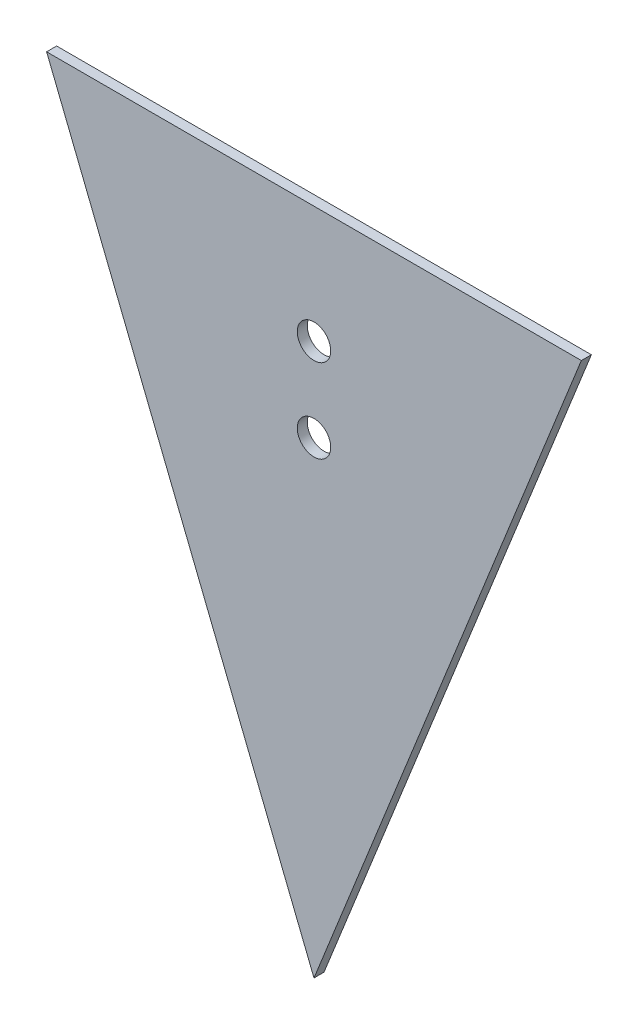
ISO-10303-21;
HEADER;
FILE_DESCRIPTION(('STEP AP214'),'2;1');
FILE_NAME('part.step','',(''),(''),'','','');
FILE_SCHEMA(('AUTOMOTIVE_DESIGN { 1 0 10303 214 1 1 1 1 }'));
ENDSEC;
DATA;
#1=APPLICATION_CONTEXT('core data for automotive mechanical design processes');
#2=APPLICATION_PROTOCOL_DEFINITION('international standard','automotive_design',2000,#1);
#3=PRODUCT_CONTEXT('',#1,'mechanical');
#4=PRODUCT('Part','Part','',(#3));
#5=PRODUCT_RELATED_PRODUCT_CATEGORY('part','',(#4));
#6=PRODUCT_DEFINITION_FORMATION('','',#4);
#7=PRODUCT_DEFINITION_CONTEXT('part definition',#1,'design');
#8=PRODUCT_DEFINITION('design','',#6,#7);
#9=PRODUCT_DEFINITION_SHAPE('','',#8);
#10=(LENGTH_UNIT() NAMED_UNIT(*) SI_UNIT(.MILLI.,.METRE.));
#11=(NAMED_UNIT(*) PLANE_ANGLE_UNIT() SI_UNIT($,.RADIAN.));
#12=(NAMED_UNIT(*) SI_UNIT($,.STERADIAN.) SOLID_ANGLE_UNIT());
#13=UNCERTAINTY_MEASURE_WITH_UNIT(LENGTH_MEASURE(1.E-05),#10,'distance_accuracy_value','');
#14=(GEOMETRIC_REPRESENTATION_CONTEXT(3) GLOBAL_UNCERTAINTY_ASSIGNED_CONTEXT((#13)) GLOBAL_UNIT_ASSIGNED_CONTEXT((#10,
#11,#12)) REPRESENTATION_CONTEXT('',''));
#15=CARTESIAN_POINT('',(0.,0.,0.));
#16=DIRECTION('',(0.,0.,1.));
#17=DIRECTION('',(1.,0.,0.));
#18=AXIS2_PLACEMENT_3D('',#15,#16,#17);
#19=CARTESIAN_POINT('',(-106.901408450704,129.718309859155,3.));
#20=DIRECTION('',(0.928476690885259,0.371390676354104,0.));
#21=DIRECTION('',(-0.371390676354104,0.928476690885259,0.));
#22=AXIS2_PLACEMENT_3D('',#19,#20,#21);
#23=PLANE('',#22);
#24=DIRECTION('',(0.371390676354104,-0.928476690885259,0.));
#25=VECTOR('',#24,1.);
#26=CARTESIAN_POINT('',(-106.901408450704,129.718309859155,0.));
#27=LINE('',#26,#25);
#28=CARTESIAN_POINT('',(-106.901408450704,129.718309859155,0.));
#29=VERTEX_POINT('',#28);
#30=CARTESIAN_POINT('',(-26.9014084507042,-70.281690140845,0.));
#31=VERTEX_POINT('',#30);
#32=EDGE_CURVE('E84',#29,#31,#27,.T.);
#33=ORIENTED_EDGE('',*,*,#32,.T.);
#34=DIRECTION('',(0.,0.,-1.));
#35=VECTOR('',#34,1.);
#36=CARTESIAN_POINT('',(-26.9014084507042,-70.281690140845,3.));
#37=LINE('',#36,#35);
#38=CARTESIAN_POINT('',(-26.9014084507042,-70.281690140845,3.));
#39=VERTEX_POINT('',#38);
#40=EDGE_CURVE('E11',#39,#31,#37,.T.);
#41=ORIENTED_EDGE('',*,*,#40,.F.);
#42=DIRECTION('',(0.371390676354104,-0.928476690885259,0.));
#43=VECTOR('',#42,1.);
#44=CARTESIAN_POINT('',(-106.901408450704,129.718309859155,3.));
#45=LINE('',#44,#43);
#46=CARTESIAN_POINT('',(-106.901408450704,129.718309859155,3.));
#47=VERTEX_POINT('',#46);
#48=EDGE_CURVE('E77',#47,#39,#45,.T.);
#49=ORIENTED_EDGE('',*,*,#48,.F.);
#50=DIRECTION('',(0.,0.,-1.));
#51=VECTOR('',#50,1.);
#52=CARTESIAN_POINT('',(-106.901408450704,129.718309859155,3.));
#53=LINE('',#52,#51);
#54=EDGE_CURVE('E85',#47,#29,#53,.T.);
#55=ORIENTED_EDGE('',*,*,#54,.T.);
#56=EDGE_LOOP('',(#33,#41,#49,#55));
#57=FACE_BOUND('',#56,.T.);
#58=ADVANCED_FACE('F37',(#57),#23,.F.);
#59=CARTESIAN_POINT('',(-26.9014084507042,-70.281690140845,3.));
#60=DIRECTION('',(-0.928476690885259,0.371390676354104,0.));
#61=DIRECTION('',(-0.371390676354104,-0.928476690885259,0.));
#62=AXIS2_PLACEMENT_3D('',#59,#60,#61);
#63=PLANE('',#62);
#64=DIRECTION('',(0.371390676354104,0.928476690885259,0.));
#65=VECTOR('',#64,1.);
#66=CARTESIAN_POINT('',(-26.9014084507042,-70.281690140845,0.));
#67=LINE('',#66,#65);
#68=CARTESIAN_POINT('',(53.0985915492958,129.718309859155,0.));
#69=VERTEX_POINT('',#68);
#70=EDGE_CURVE('E65',#31,#69,#67,.T.);
#71=ORIENTED_EDGE('',*,*,#70,.T.);
#72=DIRECTION('',(0.,0.,-1.));
#73=VECTOR('',#72,1.);
#74=CARTESIAN_POINT('',(53.0985915492958,129.718309859155,3.));
#75=LINE('',#74,#73);
#76=CARTESIAN_POINT('',(53.0985915492958,129.718309859155,3.));
#77=VERTEX_POINT('',#76);
#78=EDGE_CURVE('E45',#77,#69,#75,.T.);
#79=ORIENTED_EDGE('',*,*,#78,.F.);
#80=DIRECTION('',(0.371390676354104,0.928476690885259,0.));
#81=VECTOR('',#80,1.);
#82=CARTESIAN_POINT('',(-26.9014084507042,-70.281690140845,3.));
#83=LINE('',#82,#81);
#84=EDGE_CURVE('E73',#39,#77,#83,.T.);
#85=ORIENTED_EDGE('',*,*,#84,.F.);
#86=ORIENTED_EDGE('',*,*,#40,.T.);
#87=EDGE_LOOP('',(#71,#79,#85,#86));
#88=FACE_BOUND('',#87,.T.);
#89=ADVANCED_FACE('F74',(#88),#63,.F.);
#90=CARTESIAN_POINT('',(53.0985915492958,129.718309859155,3.));
#91=DIRECTION('',(0.,-1.,0.));
#92=DIRECTION('',(0.,0.,-1.));
#93=AXIS2_PLACEMENT_3D('',#90,#91,#92);
#94=PLANE('',#93);
#95=DIRECTION('',(-1.,0.,0.));
#96=VECTOR('',#95,1.);
#97=CARTESIAN_POINT('',(53.0985915492958,129.718309859155,0.));
#98=LINE('',#97,#96);
#99=EDGE_CURVE('E70',#69,#29,#98,.T.);
#100=ORIENTED_EDGE('',*,*,#99,.T.);
#101=ORIENTED_EDGE('',*,*,#54,.F.);
#102=DIRECTION('',(-1.,0.,0.));
#103=VECTOR('',#102,1.);
#104=CARTESIAN_POINT('',(53.0985915492958,129.718309859155,3.));
#105=LINE('',#104,#103);
#106=EDGE_CURVE('E53',#77,#47,#105,.T.);
#107=ORIENTED_EDGE('',*,*,#106,.F.);
#108=ORIENTED_EDGE('',*,*,#78,.T.);
#109=EDGE_LOOP('',(#100,#101,#107,#108));
#110=FACE_BOUND('',#109,.T.);
#111=ADVANCED_FACE('F96',(#110),#94,.F.);
#112=CARTESIAN_POINT('',(0.,0.,3.));
#113=DIRECTION('',(0.,0.,-1.));
#114=DIRECTION('',(-1.,0.,0.));
#115=AXIS2_PLACEMENT_3D('',#112,#113,#114);
#116=PLANE('',#115);
#117=CARTESIAN_POINT('',(-26.9014084507042,94.718309859155,3.));
#118=DIRECTION('',(0.,0.,1.));
#119=DIRECTION('',(1.,0.,0.));
#120=AXIS2_PLACEMENT_3D('',#117,#118,#119);
#121=CIRCLE('',#120,5.);
#122=CARTESIAN_POINT('',(-21.9014084507042,94.718309859155,3.));
#123=VERTEX_POINT('',#122);
#124=EDGE_CURVE('E87',#123,#123,#121,.T.);
#125=ORIENTED_EDGE('',*,*,#124,.F.);
#126=EDGE_LOOP('',(#125));
#127=FACE_BOUND('',#126,.T.);
#128=CARTESIAN_POINT('',(-26.9014084507042,69.718309859155,3.));
#129=DIRECTION('',(0.,0.,1.));
#130=DIRECTION('',(1.,0.,0.));
#131=AXIS2_PLACEMENT_3D('',#128,#129,#130);
#132=CIRCLE('',#131,5.);
#133=CARTESIAN_POINT('',(-21.9014084507042,69.718309859155,3.));
#134=VERTEX_POINT('',#133);
#135=EDGE_CURVE('E180',#134,#134,#132,.T.);
#136=ORIENTED_EDGE('',*,*,#135,.F.);
#137=EDGE_LOOP('',(#136));
#138=FACE_BOUND('',#137,.T.);
#139=ORIENTED_EDGE('',*,*,#48,.T.);
#140=ORIENTED_EDGE('',*,*,#84,.T.);
#141=ORIENTED_EDGE('',*,*,#106,.T.);
#142=EDGE_LOOP('',(#139,#140,#141));
#143=FACE_BOUND('',#142,.T.);
#144=ADVANCED_FACE('F80',(#127,#138,#143),#116,.F.);
#145=CARTESIAN_POINT('',(0.,0.,0.));
#146=DIRECTION('',(0.,0.,-1.));
#147=DIRECTION('',(-1.,0.,0.));
#148=AXIS2_PLACEMENT_3D('',#145,#146,#147);
#149=PLANE('',#148);
#150=CARTESIAN_POINT('',(-26.9014084507042,94.718309859155,0.));
#151=DIRECTION('',(0.,0.,-1.));
#152=DIRECTION('',(-1.,0.,0.));
#153=AXIS2_PLACEMENT_3D('',#150,#151,#152);
#154=CIRCLE('',#153,5.);
#155=CARTESIAN_POINT('',(-31.9014084507042,94.718309859155,0.));
#156=VERTEX_POINT('',#155);
#157=EDGE_CURVE('E91',#156,#156,#154,.F.);
#158=ORIENTED_EDGE('',*,*,#157,.T.);
#159=EDGE_LOOP('',(#158));
#160=FACE_BOUND('',#159,.T.);
#161=CARTESIAN_POINT('',(-26.9014084507042,69.718309859155,0.));
#162=DIRECTION('',(0.,0.,-1.));
#163=DIRECTION('',(-1.,0.,0.));
#164=AXIS2_PLACEMENT_3D('',#161,#162,#163);
#165=CIRCLE('',#164,5.);
#166=CARTESIAN_POINT('',(-31.9014084507042,69.718309859155,0.));
#167=VERTEX_POINT('',#166);
#168=EDGE_CURVE('E182',#167,#167,#165,.F.);
#169=ORIENTED_EDGE('',*,*,#168,.T.);
#170=EDGE_LOOP('',(#169));
#171=FACE_BOUND('',#170,.T.);
#172=ORIENTED_EDGE('',*,*,#32,.F.);
#173=ORIENTED_EDGE('',*,*,#99,.F.);
#174=ORIENTED_EDGE('',*,*,#70,.F.);
#175=EDGE_LOOP('',(#172,#173,#174));
#176=FACE_BOUND('',#175,.T.);
#177=ADVANCED_FACE('F97',(#160,#171,#176),#149,.T.);
#178=CARTESIAN_POINT('',(-26.9014084507042,69.718309859155,-0.00100000000000013));
#179=DIRECTION('',(0.,0.,1.));
#180=DIRECTION('',(1.,0.,0.));
#181=AXIS2_PLACEMENT_3D('',#178,#179,#180);
#182=CYLINDRICAL_SURFACE('',#181,5.);
#183=ORIENTED_EDGE('',*,*,#168,.F.);
#184=EDGE_LOOP('',(#183));
#185=FACE_BOUND('',#184,.T.);
#186=ORIENTED_EDGE('',*,*,#135,.T.);
#187=EDGE_LOOP('',(#186));
#188=FACE_BOUND('',#187,.T.);
#189=ADVANCED_FACE('F99',(#185,#188),#182,.F.);
#190=CARTESIAN_POINT('',(-26.9014084507042,94.718309859155,-0.00100000000000013));
#191=DIRECTION('',(0.,0.,1.));
#192=DIRECTION('',(1.,0.,0.));
#193=AXIS2_PLACEMENT_3D('',#190,#191,#192);
#194=CYLINDRICAL_SURFACE('',#193,5.);
#195=ORIENTED_EDGE('',*,*,#157,.F.);
#196=EDGE_LOOP('',(#195));
#197=FACE_BOUND('',#196,.T.);
#198=ORIENTED_EDGE('',*,*,#124,.T.);
#199=EDGE_LOOP('',(#198));
#200=FACE_BOUND('',#199,.T.);
#201=ADVANCED_FACE('F106',(#197,#200),#194,.F.);
#202=CLOSED_SHELL('',(#58,#89,#111,#144,#177,#189,#201));
#203=MANIFOLD_SOLID_BREP('B2',#202);
#204=ADVANCED_BREP_SHAPE_REPRESENTATION('',(#18,#203),#14);
#205=SHAPE_DEFINITION_REPRESENTATION(#9,#204);
ENDSEC;
END-ISO-10303-21;
